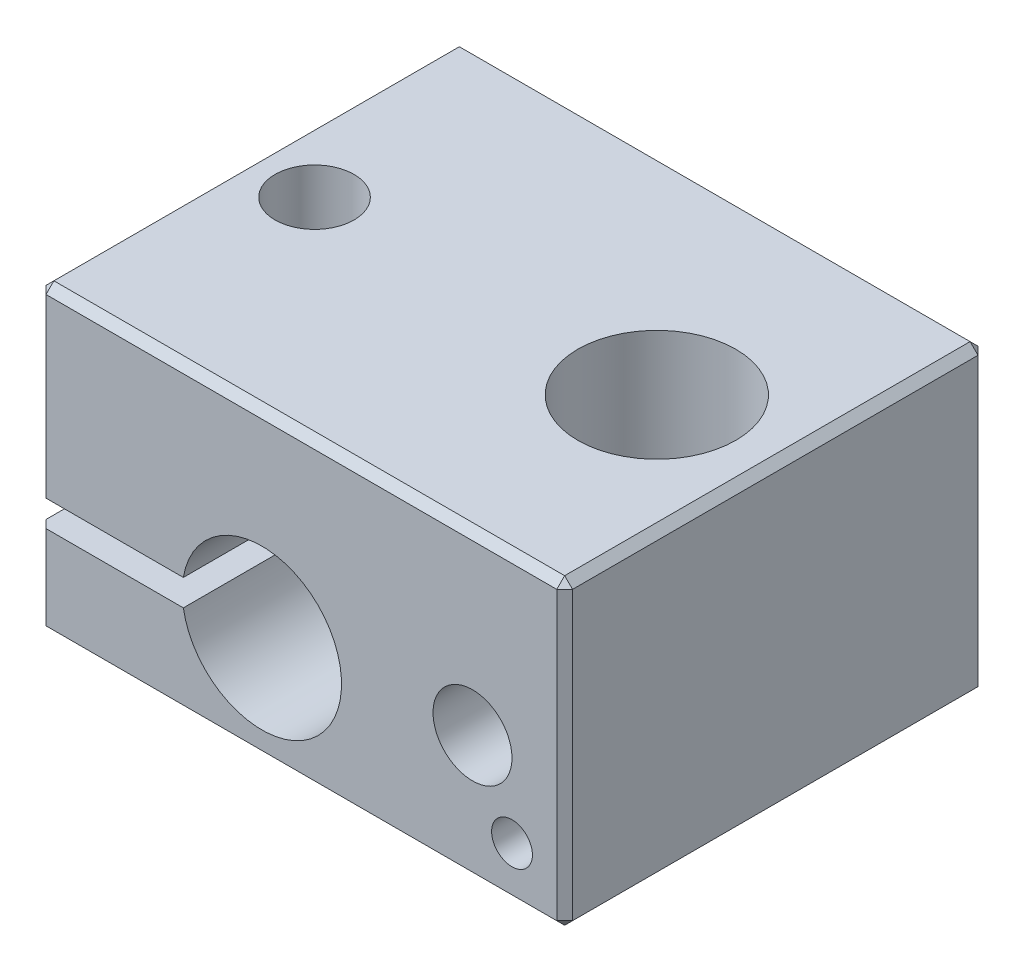
ISO-10303-21;
HEADER;
FILE_DESCRIPTION(('STEP AP214'),'2;1');
FILE_NAME('part.step','',(''),(''),'','','');
FILE_SCHEMA(('AUTOMOTIVE_DESIGN { 1 0 10303 214 1 1 1 1 }'));
ENDSEC;
DATA;
#1=APPLICATION_CONTEXT('core data for automotive mechanical design processes');
#2=APPLICATION_PROTOCOL_DEFINITION('international standard','automotive_design',2000,#1);
#3=PRODUCT_CONTEXT('',#1,'mechanical');
#4=PRODUCT('Part','Part','',(#3));
#5=PRODUCT_RELATED_PRODUCT_CATEGORY('part','',(#4));
#6=PRODUCT_DEFINITION_FORMATION('','',#4);
#7=PRODUCT_DEFINITION_CONTEXT('part definition',#1,'design');
#8=PRODUCT_DEFINITION('design','',#6,#7);
#9=PRODUCT_DEFINITION_SHAPE('','',#8);
#10=(LENGTH_UNIT() NAMED_UNIT(*) SI_UNIT(.MILLI.,.METRE.));
#11=(NAMED_UNIT(*) PLANE_ANGLE_UNIT() SI_UNIT($,.RADIAN.));
#12=(NAMED_UNIT(*) SI_UNIT($,.STERADIAN.) SOLID_ANGLE_UNIT());
#13=UNCERTAINTY_MEASURE_WITH_UNIT(LENGTH_MEASURE(1.E-05),#10,'distance_accuracy_value','');
#14=(GEOMETRIC_REPRESENTATION_CONTEXT(3) GLOBAL_UNCERTAINTY_ASSIGNED_CONTEXT((#13)) GLOBAL_UNIT_ASSIGNED_CONTEXT((#10,
#11,#12)) REPRESENTATION_CONTEXT('',''));
#15=CARTESIAN_POINT('',(0.,0.,0.));
#16=DIRECTION('',(0.,0.,1.));
#17=DIRECTION('',(1.,0.,0.));
#18=AXIS2_PLACEMENT_3D('',#15,#16,#17);
#19=CARTESIAN_POINT('',(0.,11.5,0.));
#20=DIRECTION('',(1.,0.,0.));
#21=DIRECTION('',(0.,0.,-1.));
#22=AXIS2_PLACEMENT_3D('',#19,#20,#21);
#23=PLANE('',#22);
#24=DIRECTION('',(0.,0.,1.));
#25=VECTOR('',#24,1.);
#26=CARTESIAN_POINT('',(0.,3.50000000000001,-16.));
#27=LINE('',#26,#25);
#28=CARTESIAN_POINT('',(0.,3.50000000000001,-15.7));
#29=VERTEX_POINT('',#28);
#30=CARTESIAN_POINT('',(0.,3.50000000000001,-0.300000000000001));
#31=VERTEX_POINT('',#30);
#32=EDGE_CURVE('E197',#29,#31,#27,.T.);
#33=ORIENTED_EDGE('',*,*,#32,.F.);
#34=DIRECTION('',(0.,-1.,0.));
#35=VECTOR('',#34,1.);
#36=CARTESIAN_POINT('',(0.,11.5,-15.7));
#37=LINE('',#36,#35);
#38=CARTESIAN_POINT('',(0.,0.299999999999998,-15.7));
#39=VERTEX_POINT('',#38);
#40=EDGE_CURVE('E239',#29,#39,#37,.T.);
#41=ORIENTED_EDGE('',*,*,#40,.T.);
#42=DIRECTION('',(0.,0.,1.));
#43=VECTOR('',#42,1.);
#44=CARTESIAN_POINT('',(0.,0.299999999999998,0.));
#45=LINE('',#44,#43);
#46=CARTESIAN_POINT('',(0.,0.299999999999998,-0.299999999999998));
#47=VERTEX_POINT('',#46);
#48=EDGE_CURVE('E237',#39,#47,#45,.T.);
#49=ORIENTED_EDGE('',*,*,#48,.T.);
#50=DIRECTION('',(0.,1.,0.));
#51=VECTOR('',#50,1.);
#52=CARTESIAN_POINT('',(0.,11.5,-0.299999999999998));
#53=LINE('',#52,#51);
#54=EDGE_CURVE('E235',#47,#31,#53,.T.);
#55=ORIENTED_EDGE('',*,*,#54,.T.);
#56=EDGE_LOOP('',(#33,#41,#49,#55));
#57=FACE_BOUND('',#56,.T.);
#58=ADVANCED_FACE('F33',(#57),#23,.F.);
#59=CARTESIAN_POINT('',(0.,11.5,0.));
#60=DIRECTION('',(0.,0.,-1.));
#61=DIRECTION('',(-1.,0.,0.));
#62=AXIS2_PLACEMENT_3D('',#59,#60,#61);
#63=PLANE('',#62);
#64=DIRECTION('',(-1.,0.,0.));
#65=VECTOR('',#64,1.);
#66=CARTESIAN_POINT('',(0.,3.50000000000001,0.));
#67=LINE('',#66,#65);
#68=CARTESIAN_POINT('',(5.5166084735657,3.50000000000001,0.));
#69=VERTEX_POINT('',#68);
#70=CARTESIAN_POINT('',(0.300000000000002,3.50000000000001,0.));
#71=VERTEX_POINT('',#70);
#72=EDGE_CURVE('E182',#69,#71,#67,.T.);
#73=ORIENTED_EDGE('',*,*,#72,.T.);
#74=DIRECTION('',(0.,-1.,0.));
#75=VECTOR('',#74,1.);
#76=CARTESIAN_POINT('',(0.299999999999998,11.5,0.));
#77=LINE('',#76,#75);
#78=CARTESIAN_POINT('',(0.299999999999998,0.299999999999998,0.));
#79=VERTEX_POINT('',#78);
#80=EDGE_CURVE('E11',#71,#79,#77,.T.);
#81=ORIENTED_EDGE('',*,*,#80,.T.);
#82=DIRECTION('',(1.,0.,0.));
#83=VECTOR('',#82,1.);
#84=CARTESIAN_POINT('',(20.,0.299999999999998,0.));
#85=LINE('',#84,#83);
#86=CARTESIAN_POINT('',(19.7,0.299999999999998,0.));
#87=VERTEX_POINT('',#86);
#88=EDGE_CURVE('E42',#79,#87,#85,.T.);
#89=ORIENTED_EDGE('',*,*,#88,.T.);
#90=DIRECTION('',(0.,1.,0.));
#91=VECTOR('',#90,1.);
#92=CARTESIAN_POINT('',(19.7,11.5,0.));
#93=LINE('',#92,#91);
#94=CARTESIAN_POINT('',(19.7,11.2,0.));
#95=VERTEX_POINT('',#94);
#96=EDGE_CURVE('E280',#87,#95,#93,.T.);
#97=ORIENTED_EDGE('',*,*,#96,.T.);
#98=DIRECTION('',(-1.,0.,0.));
#99=VECTOR('',#98,1.);
#100=CARTESIAN_POINT('',(0.,11.2,0.));
#101=LINE('',#100,#99);
#102=CARTESIAN_POINT('',(0.299999999999998,11.2,0.));
#103=VERTEX_POINT('',#102);
#104=EDGE_CURVE('E276',#95,#103,#101,.T.);
#105=ORIENTED_EDGE('',*,*,#104,.T.);
#106=DIRECTION('',(0.,-1.,0.));
#107=VECTOR('',#106,1.);
#108=CARTESIAN_POINT('',(0.299999999999998,11.5,0.));
#109=LINE('',#108,#107);
#110=CARTESIAN_POINT('',(0.299999999999998,4.50000000000001,0.));
#111=VERTEX_POINT('',#110);
#112=EDGE_CURVE('E278',#103,#111,#109,.T.);
#113=ORIENTED_EDGE('',*,*,#112,.T.);
#114=DIRECTION('',(-1.,0.,0.));
#115=VECTOR('',#114,1.);
#116=CARTESIAN_POINT('',(0.,4.50000000000001,0.));
#117=LINE('',#116,#115);
#118=CARTESIAN_POINT('',(5.5166084735657,4.50000000000001,0.));
#119=VERTEX_POINT('',#118);
#120=EDGE_CURVE('E184',#119,#111,#117,.T.);
#121=ORIENTED_EDGE('',*,*,#120,.F.);
#122=CARTESIAN_POINT('',(8.5,4.,0.));
#123=DIRECTION('',(0.,0.,1.));
#124=DIRECTION('',(1.,0.,0.));
#125=AXIS2_PLACEMENT_3D('',#122,#123,#124);
#126=CIRCLE('',#125,3.025);
#127=EDGE_CURVE('E164',#69,#119,#126,.T.);
#128=ORIENTED_EDGE('',*,*,#127,.F.);
#129=EDGE_LOOP('',(#73,#81,#89,#97,#105,#113,#121,#128));
#130=FACE_BOUND('',#129,.T.);
#131=CARTESIAN_POINT('',(18.,2.,0.));
#132=DIRECTION('',(0.,0.,1.));
#133=DIRECTION('',(1.,0.,0.));
#134=AXIS2_PLACEMENT_3D('',#131,#132,#133);
#135=CIRCLE('',#134,0.775000000000001);
#136=CARTESIAN_POINT('',(18.775,2.,0.));
#137=VERTEX_POINT('',#136);
#138=EDGE_CURVE('E352',#137,#137,#135,.T.);
#139=ORIENTED_EDGE('',*,*,#138,.F.);
#140=EDGE_LOOP('',(#139));
#141=FACE_BOUND('',#140,.T.);
#142=CARTESIAN_POINT('',(16.5,4.8,0.));
#143=DIRECTION('',(0.,0.,1.));
#144=DIRECTION('',(1.,0.,0.));
#145=AXIS2_PLACEMENT_3D('',#142,#143,#144);
#146=CIRCLE('',#145,1.5);
#147=CARTESIAN_POINT('',(18.,4.8,0.));
#148=VERTEX_POINT('',#147);
#149=EDGE_CURVE('E187',#148,#148,#146,.T.);
#150=ORIENTED_EDGE('',*,*,#149,.F.);
#151=EDGE_LOOP('',(#150));
#152=FACE_BOUND('',#151,.T.);
#153=ADVANCED_FACE('F369',(#130,#141,#152),#63,.F.);
#154=CARTESIAN_POINT('',(0.,11.5,-16.));
#155=DIRECTION('',(0.,0.,1.));
#156=DIRECTION('',(1.,0.,0.));
#157=AXIS2_PLACEMENT_3D('',#154,#155,#156);
#158=PLANE('',#157);
#159=DIRECTION('',(-1.,0.,0.));
#160=VECTOR('',#159,1.);
#161=CARTESIAN_POINT('',(0.,0.299999999999998,-16.));
#162=LINE('',#161,#160);
#163=CARTESIAN_POINT('',(19.7,0.299999999999998,-16.));
#164=VERTEX_POINT('',#163);
#165=CARTESIAN_POINT('',(0.299999999999998,0.299999999999998,-16.));
#166=VERTEX_POINT('',#165);
#167=EDGE_CURVE('E265',#164,#166,#162,.T.);
#168=ORIENTED_EDGE('',*,*,#167,.T.);
#169=DIRECTION('',(0.,1.,0.));
#170=VECTOR('',#169,1.);
#171=CARTESIAN_POINT('',(0.299999999999998,11.5,-16.));
#172=LINE('',#171,#170);
#173=CARTESIAN_POINT('',(0.299999999999996,3.50000000000001,-16.));
#174=VERTEX_POINT('',#173);
#175=EDGE_CURVE('E267',#166,#174,#172,.T.);
#176=ORIENTED_EDGE('',*,*,#175,.T.);
#177=DIRECTION('',(-1.,0.,0.));
#178=VECTOR('',#177,1.);
#179=CARTESIAN_POINT('',(0.,3.50000000000001,-16.));
#180=LINE('',#179,#178);
#181=CARTESIAN_POINT('',(5.5166084735657,3.50000000000001,-16.));
#182=VERTEX_POINT('',#181);
#183=EDGE_CURVE('E169',#182,#174,#180,.T.);
#184=ORIENTED_EDGE('',*,*,#183,.F.);
#185=CARTESIAN_POINT('',(8.5,4.,-16.));
#186=DIRECTION('',(0.,0.,1.));
#187=DIRECTION('',(1.,0.,0.));
#188=AXIS2_PLACEMENT_3D('',#185,#186,#187);
#189=CIRCLE('',#188,3.025);
#190=CARTESIAN_POINT('',(5.5166084735657,4.50000000000001,-16.));
#191=VERTEX_POINT('',#190);
#192=EDGE_CURVE('E161',#182,#191,#189,.T.);
#193=ORIENTED_EDGE('',*,*,#192,.T.);
#194=DIRECTION('',(-1.,0.,0.));
#195=VECTOR('',#194,1.);
#196=CARTESIAN_POINT('',(0.,4.50000000000001,-16.));
#197=LINE('',#196,#195);
#198=CARTESIAN_POINT('',(0.299999999999998,4.50000000000001,-16.));
#199=VERTEX_POINT('',#198);
#200=EDGE_CURVE('E172',#191,#199,#197,.T.);
#201=ORIENTED_EDGE('',*,*,#200,.T.);
#202=DIRECTION('',(0.,1.,0.));
#203=VECTOR('',#202,1.);
#204=CARTESIAN_POINT('',(0.299999999999998,11.5,-16.));
#205=LINE('',#204,#203);
#206=CARTESIAN_POINT('',(0.299999999999998,11.2,-16.));
#207=VERTEX_POINT('',#206);
#208=EDGE_CURVE('E261',#199,#207,#205,.T.);
#209=ORIENTED_EDGE('',*,*,#208,.T.);
#210=DIRECTION('',(1.,0.,0.));
#211=VECTOR('',#210,1.);
#212=CARTESIAN_POINT('',(0.,11.2,-16.));
#213=LINE('',#212,#211);
#214=CARTESIAN_POINT('',(19.7,11.2,-16.));
#215=VERTEX_POINT('',#214);
#216=EDGE_CURVE('E259',#207,#215,#213,.T.);
#217=ORIENTED_EDGE('',*,*,#216,.T.);
#218=DIRECTION('',(0.,-1.,0.));
#219=VECTOR('',#218,1.);
#220=CARTESIAN_POINT('',(19.7,11.5,-16.));
#221=LINE('',#220,#219);
#222=EDGE_CURVE('E263',#215,#164,#221,.T.);
#223=ORIENTED_EDGE('',*,*,#222,.T.);
#224=EDGE_LOOP('',(#168,#176,#184,#193,#201,#209,#217,#223));
#225=FACE_BOUND('',#224,.T.);
#226=ADVANCED_FACE('F180',(#225),#158,.F.);
#227=CARTESIAN_POINT('',(2.5,11.5,-8.));
#228=DIRECTION('',(0.,-1.,0.));
#229=DIRECTION('',(0.,0.,-1.));
#230=AXIS2_PLACEMENT_3D('',#227,#228,#229);
#231=CYLINDRICAL_SURFACE('',#230,1.5);
#232=CARTESIAN_POINT('',(2.5,0.,-8.));
#233=DIRECTION('',(0.,1.,0.));
#234=DIRECTION('',(0.,0.,1.));
#235=AXIS2_PLACEMENT_3D('',#232,#233,#234);
#236=CIRCLE('',#235,1.5);
#237=CARTESIAN_POINT('',(2.5,0.,-6.5));
#238=VERTEX_POINT('',#237);
#239=EDGE_CURVE('E206',#238,#238,#236,.T.);
#240=ORIENTED_EDGE('',*,*,#239,.F.);
#241=EDGE_LOOP('',(#240));
#242=FACE_BOUND('',#241,.T.);
#243=CARTESIAN_POINT('',(2.5,3.50000000000001,-8.));
#244=DIRECTION('',(0.,1.,0.));
#245=DIRECTION('',(0.,0.,1.));
#246=AXIS2_PLACEMENT_3D('',#243,#244,#245);
#247=CIRCLE('',#246,1.5);
#248=CARTESIAN_POINT('',(2.5,3.50000000000001,-6.5));
#249=VERTEX_POINT('',#248);
#250=EDGE_CURVE('E209',#249,#249,#247,.T.);
#251=ORIENTED_EDGE('',*,*,#250,.T.);
#252=EDGE_LOOP('',(#251));
#253=FACE_BOUND('',#252,.T.);
#254=ADVANCED_FACE('F376',(#242,#253),#231,.F.);
#255=CARTESIAN_POINT('',(0.,11.5,0.));
#256=DIRECTION('',(0.,-1.,0.));
#257=DIRECTION('',(0.,0.,-1.));
#258=AXIS2_PLACEMENT_3D('',#255,#256,#257);
#259=PLANE('',#258);
#260=DIRECTION('',(-1.,0.,0.));
#261=VECTOR('',#260,1.);
#262=CARTESIAN_POINT('',(0.,11.5,-15.7));
#263=LINE('',#262,#261);
#264=CARTESIAN_POINT('',(19.7,11.5,-15.7));
#265=VERTEX_POINT('',#264);
#266=CARTESIAN_POINT('',(0.299999999999998,11.5,-15.7));
#267=VERTEX_POINT('',#266);
#268=EDGE_CURVE('E223',#265,#267,#263,.T.);
#269=ORIENTED_EDGE('',*,*,#268,.T.);
#270=DIRECTION('',(0.,0.,1.));
#271=VECTOR('',#270,1.);
#272=CARTESIAN_POINT('',(0.299999999999998,11.5,0.));
#273=LINE('',#272,#271);
#274=CARTESIAN_POINT('',(0.299999999999998,11.5,-0.299999999999998));
#275=VERTEX_POINT('',#274);
#276=EDGE_CURVE('E225',#267,#275,#273,.T.);
#277=ORIENTED_EDGE('',*,*,#276,.T.);
#278=DIRECTION('',(1.,0.,0.));
#279=VECTOR('',#278,1.);
#280=CARTESIAN_POINT('',(0.,11.5,-0.299999999999998));
#281=LINE('',#280,#279);
#282=CARTESIAN_POINT('',(19.7,11.5,-0.299999999999998));
#283=VERTEX_POINT('',#282);
#284=EDGE_CURVE('E213',#275,#283,#281,.T.);
#285=ORIENTED_EDGE('',*,*,#284,.T.);
#286=DIRECTION('',(0.,0.,-1.));
#287=VECTOR('',#286,1.);
#288=CARTESIAN_POINT('',(19.7,11.5,0.));
#289=LINE('',#288,#287);
#290=EDGE_CURVE('E221',#283,#265,#289,.T.);
#291=ORIENTED_EDGE('',*,*,#290,.T.);
#292=EDGE_LOOP('',(#269,#277,#285,#291));
#293=FACE_BOUND('',#292,.T.);
#294=CARTESIAN_POINT('',(15.5,11.5,-8.));
#295=DIRECTION('',(0.,1.,0.));
#296=DIRECTION('',(0.,0.,1.));
#297=AXIS2_PLACEMENT_3D('',#294,#295,#296);
#298=CIRCLE('',#297,3.);
#299=CARTESIAN_POINT('',(15.5,11.5,-5.));
#300=VERTEX_POINT('',#299);
#301=EDGE_CURVE('E210',#300,#300,#298,.T.);
#302=ORIENTED_EDGE('',*,*,#301,.F.);
#303=EDGE_LOOP('',(#302));
#304=FACE_BOUND('',#303,.T.);
#305=CARTESIAN_POINT('',(2.5,11.5,-8.));
#306=DIRECTION('',(0.,1.,0.));
#307=DIRECTION('',(0.,0.,1.));
#308=AXIS2_PLACEMENT_3D('',#305,#306,#307);
#309=CIRCLE('',#308,1.5);
#310=CARTESIAN_POINT('',(2.5,11.5,-6.5));
#311=VERTEX_POINT('',#310);
#312=EDGE_CURVE('E202',#311,#311,#309,.T.);
#313=ORIENTED_EDGE('',*,*,#312,.F.);
#314=EDGE_LOOP('',(#313));
#315=FACE_BOUND('',#314,.T.);
#316=ADVANCED_FACE('F512',(#293,#304,#315),#259,.F.);
#317=CARTESIAN_POINT('',(0.,0.,0.));
#318=DIRECTION('',(0.,-1.,0.));
#319=DIRECTION('',(0.,0.,-1.));
#320=AXIS2_PLACEMENT_3D('',#317,#318,#319);
#321=PLANE('',#320);
#322=DIRECTION('',(0.,0.,-1.));
#323=VECTOR('',#322,1.);
#324=CARTESIAN_POINT('',(0.299999999999998,0.,-16.));
#325=LINE('',#324,#323);
#326=CARTESIAN_POINT('',(0.299999999999998,0.,-0.299999999999998));
#327=VERTEX_POINT('',#326);
#328=CARTESIAN_POINT('',(0.299999999999998,0.,-15.7));
#329=VERTEX_POINT('',#328);
#330=EDGE_CURVE('E245',#327,#329,#325,.T.);
#331=ORIENTED_EDGE('',*,*,#330,.T.);
#332=DIRECTION('',(1.,0.,0.));
#333=VECTOR('',#332,1.);
#334=CARTESIAN_POINT('',(20.,0.,-15.7));
#335=LINE('',#334,#333);
#336=CARTESIAN_POINT('',(19.7,0.,-15.7));
#337=VERTEX_POINT('',#336);
#338=EDGE_CURVE('E248',#329,#337,#335,.T.);
#339=ORIENTED_EDGE('',*,*,#338,.T.);
#340=DIRECTION('',(0.,0.,1.));
#341=VECTOR('',#340,1.);
#342=CARTESIAN_POINT('',(19.7,0.,0.));
#343=LINE('',#342,#341);
#344=CARTESIAN_POINT('',(19.7,0.,-0.299999999999998));
#345=VERTEX_POINT('',#344);
#346=EDGE_CURVE('E243',#337,#345,#343,.T.);
#347=ORIENTED_EDGE('',*,*,#346,.T.);
#348=DIRECTION('',(-1.,0.,0.));
#349=VECTOR('',#348,1.);
#350=CARTESIAN_POINT('',(0.,0.,-0.299999999999998));
#351=LINE('',#350,#349);
#352=EDGE_CURVE('E241',#345,#327,#351,.T.);
#353=ORIENTED_EDGE('',*,*,#352,.T.);
#354=EDGE_LOOP('',(#331,#339,#347,#353));
#355=FACE_BOUND('',#354,.T.);
#356=CARTESIAN_POINT('',(15.5,0.,-8.));
#357=DIRECTION('',(0.,1.,0.));
#358=DIRECTION('',(0.,0.,1.));
#359=AXIS2_PLACEMENT_3D('',#356,#357,#358);
#360=CIRCLE('',#359,3.);
#361=CARTESIAN_POINT('',(15.5,0.,-5.));
#362=VERTEX_POINT('',#361);
#363=EDGE_CURVE('E205',#362,#362,#360,.T.);
#364=ORIENTED_EDGE('',*,*,#363,.T.);
#365=EDGE_LOOP('',(#364));
#366=FACE_BOUND('',#365,.T.);
#367=ORIENTED_EDGE('',*,*,#239,.T.);
#368=EDGE_LOOP('',(#367));
#369=FACE_BOUND('',#368,.T.);
#370=ADVANCED_FACE('F386',(#355,#366,#369),#321,.T.);
#371=DIRECTION('',(0.,0.,-1.));
#372=VECTOR('',#371,1.);
#373=CARTESIAN_POINT('',(0.,11.2,0.));
#374=LINE('',#373,#372);
#375=CARTESIAN_POINT('',(0.,11.2,-0.299999999999998));
#376=VERTEX_POINT('',#375);
#377=CARTESIAN_POINT('',(0.,11.2,-15.7));
#378=VERTEX_POINT('',#377);
#379=EDGE_CURVE('E230',#376,#378,#374,.T.);
#380=ORIENTED_EDGE('',*,*,#379,.T.);
#381=DIRECTION('',(0.,-1.,0.));
#382=VECTOR('',#381,1.);
#383=CARTESIAN_POINT('',(0.,11.5,-15.7));
#384=LINE('',#383,#382);
#385=CARTESIAN_POINT('',(0.,4.50000000000001,-15.7));
#386=VERTEX_POINT('',#385);
#387=EDGE_CURVE('E233',#378,#386,#384,.T.);
#388=ORIENTED_EDGE('',*,*,#387,.T.);
#389=DIRECTION('',(0.,0.,1.));
#390=VECTOR('',#389,1.);
#391=CARTESIAN_POINT('',(0.,4.50000000000001,-16.));
#392=LINE('',#391,#390);
#393=CARTESIAN_POINT('',(0.,4.50000000000001,-0.299999999999998));
#394=VERTEX_POINT('',#393);
#395=EDGE_CURVE('E168',#386,#394,#392,.T.);
#396=ORIENTED_EDGE('',*,*,#395,.T.);
#397=DIRECTION('',(0.,1.,0.));
#398=VECTOR('',#397,1.);
#399=CARTESIAN_POINT('',(0.,11.5,-0.299999999999998));
#400=LINE('',#399,#398);
#401=EDGE_CURVE('E228',#394,#376,#400,.T.);
#402=ORIENTED_EDGE('',*,*,#401,.T.);
#403=EDGE_LOOP('',(#380,#388,#396,#402));
#404=FACE_BOUND('',#403,.T.);
#405=ADVANCED_FACE('F380',(#404),#23,.F.);
#406=CARTESIAN_POINT('',(20.,11.5,0.));
#407=DIRECTION('',(-1.,0.,0.));
#408=DIRECTION('',(0.,0.,1.));
#409=AXIS2_PLACEMENT_3D('',#406,#407,#408);
#410=PLANE('',#409);
#411=DIRECTION('',(0.,-1.,0.));
#412=VECTOR('',#411,1.);
#413=CARTESIAN_POINT('',(20.,11.5,-0.299999999999998));
#414=LINE('',#413,#412);
#415=CARTESIAN_POINT('',(20.,11.2,-0.299999999999998));
#416=VERTEX_POINT('',#415);
#417=CARTESIAN_POINT('',(20.,0.299999999999998,-0.299999999999998));
#418=VERTEX_POINT('',#417);
#419=EDGE_CURVE('E250',#416,#418,#414,.T.);
#420=ORIENTED_EDGE('',*,*,#419,.T.);
#421=DIRECTION('',(0.,0.,-1.));
#422=VECTOR('',#421,1.);
#423=CARTESIAN_POINT('',(20.,0.299999999999998,-16.));
#424=LINE('',#423,#422);
#425=CARTESIAN_POINT('',(20.,0.299999999999998,-15.7));
#426=VERTEX_POINT('',#425);
#427=EDGE_CURVE('E256',#418,#426,#424,.T.);
#428=ORIENTED_EDGE('',*,*,#427,.T.);
#429=DIRECTION('',(0.,1.,0.));
#430=VECTOR('',#429,1.);
#431=CARTESIAN_POINT('',(20.,11.5,-15.7));
#432=LINE('',#431,#430);
#433=CARTESIAN_POINT('',(20.,11.2,-15.7));
#434=VERTEX_POINT('',#433);
#435=EDGE_CURVE('E254',#426,#434,#432,.T.);
#436=ORIENTED_EDGE('',*,*,#435,.T.);
#437=DIRECTION('',(0.,0.,1.));
#438=VECTOR('',#437,1.);
#439=CARTESIAN_POINT('',(20.,11.2,0.));
#440=LINE('',#439,#438);
#441=EDGE_CURVE('E252',#434,#416,#440,.T.);
#442=ORIENTED_EDGE('',*,*,#441,.T.);
#443=EDGE_LOOP('',(#420,#428,#436,#442));
#444=FACE_BOUND('',#443,.T.);
#445=ADVANCED_FACE('F383',(#444),#410,.F.);
#446=CARTESIAN_POINT('',(15.5,11.5,-8.));
#447=DIRECTION('',(0.,-1.,0.));
#448=DIRECTION('',(0.,0.,-1.));
#449=AXIS2_PLACEMENT_3D('',#446,#447,#448);
#450=CYLINDRICAL_SURFACE('',#449,3.);
#451=ORIENTED_EDGE('',*,*,#301,.T.);
#452=EDGE_LOOP('',(#451));
#453=FACE_BOUND('',#452,.T.);
#454=ORIENTED_EDGE('',*,*,#363,.F.);
#455=EDGE_LOOP('',(#454));
#456=FACE_BOUND('',#455,.T.);
#457=ADVANCED_FACE('F537',(#453,#456),#450,.F.);
#458=CARTESIAN_POINT('',(2.5,4.50000000000001,-8.));
#459=DIRECTION('',(0.,1.,0.));
#460=DIRECTION('',(0.,0.,1.));
#461=AXIS2_PLACEMENT_3D('',#458,#459,#460);
#462=CIRCLE('',#461,1.5);
#463=CARTESIAN_POINT('',(2.5,4.50000000000001,-6.5));
#464=VERTEX_POINT('',#463);
#465=EDGE_CURVE('E196',#464,#464,#462,.T.);
#466=ORIENTED_EDGE('',*,*,#465,.F.);
#467=EDGE_LOOP('',(#466));
#468=FACE_BOUND('',#467,.T.);
#469=ORIENTED_EDGE('',*,*,#312,.T.);
#470=EDGE_LOOP('',(#469));
#471=FACE_BOUND('',#470,.T.);
#472=ADVANCED_FACE('F521',(#468,#471),#231,.F.);
#473=CARTESIAN_POINT('',(8.5,4.,-16.));
#474=DIRECTION('',(0.,0.,1.));
#475=DIRECTION('',(1.,0.,0.));
#476=AXIS2_PLACEMENT_3D('',#473,#474,#475);
#477=CYLINDRICAL_SURFACE('',#476,3.025);
#478=ORIENTED_EDGE('',*,*,#127,.T.);
#479=DIRECTION('',(0.,0.,1.));
#480=VECTOR('',#479,1.);
#481=CARTESIAN_POINT('',(5.5166084735657,4.50000000000001,-16.));
#482=LINE('',#481,#480);
#483=EDGE_CURVE('E157',#191,#119,#482,.T.);
#484=ORIENTED_EDGE('',*,*,#483,.F.);
#485=ORIENTED_EDGE('',*,*,#192,.F.);
#486=DIRECTION('',(0.,0.,1.));
#487=VECTOR('',#486,1.);
#488=CARTESIAN_POINT('',(5.5166084735657,3.50000000000001,-16.));
#489=LINE('',#488,#487);
#490=EDGE_CURVE('E194',#182,#69,#489,.T.);
#491=ORIENTED_EDGE('',*,*,#490,.T.);
#492=EDGE_LOOP('',(#478,#484,#485,#491));
#493=FACE_BOUND('',#492,.T.);
#494=ADVANCED_FACE('F159',(#493),#477,.F.);
#495=CARTESIAN_POINT('',(0.,3.50000000000001,-16.));
#496=DIRECTION('',(0.,1.,0.));
#497=DIRECTION('',(0.,0.,1.));
#498=AXIS2_PLACEMENT_3D('',#495,#496,#497);
#499=PLANE('',#498);
#500=ORIENTED_EDGE('',*,*,#250,.F.);
#501=EDGE_LOOP('',(#500));
#502=FACE_BOUND('',#501,.T.);
#503=ORIENTED_EDGE('',*,*,#183,.T.);
#504=DIRECTION('',(0.707106781186548,0.,-0.707106781186548));
#505=VECTOR('',#504,1.);
#506=CARTESIAN_POINT('',(0.149999999999999,3.50000000000001,-15.85));
#507=LINE('',#506,#505);
#508=EDGE_CURVE('E271',#174,#29,#507,.F.);
#509=ORIENTED_EDGE('',*,*,#508,.T.);
#510=ORIENTED_EDGE('',*,*,#32,.T.);
#511=DIRECTION('',(-0.707106781186548,0.,-0.707106781186548));
#512=VECTOR('',#511,1.);
#513=CARTESIAN_POINT('',(-7.85,3.50000000000001,-8.15));
#514=LINE('',#513,#512);
#515=EDGE_CURVE('E269',#31,#71,#514,.F.);
#516=ORIENTED_EDGE('',*,*,#515,.T.);
#517=ORIENTED_EDGE('',*,*,#72,.F.);
#518=ORIENTED_EDGE('',*,*,#490,.F.);
#519=EDGE_LOOP('',(#503,#509,#510,#516,#517,#518));
#520=FACE_BOUND('',#519,.T.);
#521=ADVANCED_FACE('F483',(#502,#520),#499,.T.);
#522=CARTESIAN_POINT('',(0.,4.50000000000001,-16.));
#523=DIRECTION('',(0.,1.,0.));
#524=DIRECTION('',(0.,0.,1.));
#525=AXIS2_PLACEMENT_3D('',#522,#523,#524);
#526=PLANE('',#525);
#527=ORIENTED_EDGE('',*,*,#465,.T.);
#528=EDGE_LOOP('',(#527));
#529=FACE_BOUND('',#528,.T.);
#530=ORIENTED_EDGE('',*,*,#395,.F.);
#531=DIRECTION('',(-0.707106781186548,0.,0.707106781186548));
#532=VECTOR('',#531,1.);
#533=CARTESIAN_POINT('',(0.,4.50000000000001,-15.7));
#534=LINE('',#533,#532);
#535=EDGE_CURVE('E176',#386,#199,#534,.F.);
#536=ORIENTED_EDGE('',*,*,#535,.T.);
#537=ORIENTED_EDGE('',*,*,#200,.F.);
#538=ORIENTED_EDGE('',*,*,#483,.T.);
#539=ORIENTED_EDGE('',*,*,#120,.T.);
#540=DIRECTION('',(0.707106781186548,0.,0.707106781186548));
#541=VECTOR('',#540,1.);
#542=CARTESIAN_POINT('',(0.299999999999998,4.50000000000001,0.));
#543=LINE('',#542,#541);
#544=EDGE_CURVE('E273',#111,#394,#543,.F.);
#545=ORIENTED_EDGE('',*,*,#544,.T.);
#546=EDGE_LOOP('',(#530,#536,#537,#538,#539,#545));
#547=FACE_BOUND('',#546,.T.);
#548=ADVANCED_FACE('F174',(#529,#547),#526,.F.);
#549=CARTESIAN_POINT('',(16.5,4.8,-4.));
#550=DIRECTION('',(0.,0.,1.));
#551=DIRECTION('',(1.,0.,0.));
#552=AXIS2_PLACEMENT_3D('',#549,#550,#551);
#553=CYLINDRICAL_SURFACE('',#552,1.5);
#554=CARTESIAN_POINT('',(16.5,4.8,-4.));
#555=DIRECTION('',(0.,0.,1.));
#556=DIRECTION('',(1.,0.,0.));
#557=AXIS2_PLACEMENT_3D('',#554,#555,#556);
#558=CIRCLE('',#557,1.5);
#559=CARTESIAN_POINT('',(18.,4.8,-4.));
#560=VERTEX_POINT('',#559);
#561=EDGE_CURVE('E192',#560,#560,#558,.T.);
#562=ORIENTED_EDGE('',*,*,#561,.F.);
#563=EDGE_LOOP('',(#562));
#564=FACE_BOUND('',#563,.T.);
#565=ORIENTED_EDGE('',*,*,#149,.T.);
#566=EDGE_LOOP('',(#565));
#567=FACE_BOUND('',#566,.T.);
#568=ADVANCED_FACE('F367',(#564,#567),#553,.F.);
#569=CARTESIAN_POINT('',(16.5,4.8,-4.));
#570=DIRECTION('',(0.,0.,1.));
#571=DIRECTION('',(1.,0.,0.));
#572=AXIS2_PLACEMENT_3D('',#569,#570,#571);
#573=PLANE('',#572);
#574=ORIENTED_EDGE('',*,*,#561,.T.);
#575=EDGE_LOOP('',(#574));
#576=FACE_BOUND('',#575,.T.);
#577=ADVANCED_FACE('F606',(#576),#573,.T.);
#578=CARTESIAN_POINT('',(18.,2.,-4.));
#579=DIRECTION('',(0.,0.,1.));
#580=DIRECTION('',(1.,0.,0.));
#581=AXIS2_PLACEMENT_3D('',#578,#579,#580);
#582=CYLINDRICAL_SURFACE('',#581,0.775000000000001);
#583=CARTESIAN_POINT('',(18.,2.,-4.));
#584=DIRECTION('',(0.,0.,1.));
#585=DIRECTION('',(1.,0.,0.));
#586=AXIS2_PLACEMENT_3D('',#583,#584,#585);
#587=CIRCLE('',#586,0.775000000000001);
#588=CARTESIAN_POINT('',(18.775,2.,-4.));
#589=VERTEX_POINT('',#588);
#590=EDGE_CURVE('E355',#589,#589,#587,.T.);
#591=ORIENTED_EDGE('',*,*,#590,.F.);
#592=EDGE_LOOP('',(#591));
#593=FACE_BOUND('',#592,.T.);
#594=ORIENTED_EDGE('',*,*,#138,.T.);
#595=EDGE_LOOP('',(#594));
#596=FACE_BOUND('',#595,.T.);
#597=ADVANCED_FACE('F616',(#593,#596),#582,.F.);
#598=CARTESIAN_POINT('',(18.,2.,-4.));
#599=DIRECTION('',(0.,0.,1.));
#600=DIRECTION('',(1.,0.,0.));
#601=AXIS2_PLACEMENT_3D('',#598,#599,#600);
#602=PLANE('',#601);
#603=ORIENTED_EDGE('',*,*,#590,.T.);
#604=EDGE_LOOP('',(#603));
#605=FACE_BOUND('',#604,.T.);
#606=ADVANCED_FACE('F472',(#605),#602,.T.);
#607=CARTESIAN_POINT('',(0.,11.5,-15.7));
#608=DIRECTION('',(0.707106781186547,0.,0.707106781186547));
#609=DIRECTION('',(0.,-1.,0.));
#610=AXIS2_PLACEMENT_3D('',#607,#608,#609);
#611=PLANE('',#610);
#612=ORIENTED_EDGE('',*,*,#508,.F.);
#613=ORIENTED_EDGE('',*,*,#175,.F.);
#614=DIRECTION('',(-0.707106781186547,0.,0.707106781186547));
#615=VECTOR('',#614,1.);
#616=CARTESIAN_POINT('',(0.149999999999999,0.299999999999998,-15.85));
#617=LINE('',#616,#615);
#618=EDGE_CURVE('E37',#39,#166,#617,.F.);
#619=ORIENTED_EDGE('',*,*,#618,.F.);
#620=ORIENTED_EDGE('',*,*,#40,.F.);
#621=EDGE_LOOP('',(#612,#613,#619,#620));
#622=FACE_BOUND('',#621,.T.);
#623=ADVANCED_FACE('F35',(#622),#611,.F.);
#624=CARTESIAN_POINT('',(0.,0.299999999999998,0.));
#625=DIRECTION('',(-0.707106781186547,-0.707106781186547,0.));
#626=DIRECTION('',(0.,0.,-1.));
#627=AXIS2_PLACEMENT_3D('',#624,#625,#626);
#628=PLANE('',#627);
#629=DIRECTION('',(0.707106781186547,-0.707106781186547,0.));
#630=VECTOR('',#629,1.);
#631=CARTESIAN_POINT('',(0.,0.299999999999998,-0.299999999999998));
#632=LINE('',#631,#630);
#633=EDGE_CURVE('E344',#47,#327,#632,.T.);
#634=ORIENTED_EDGE('',*,*,#633,.F.);
#635=ORIENTED_EDGE('',*,*,#48,.F.);
#636=DIRECTION('',(-0.707106781186547,0.707106781186547,0.));
#637=VECTOR('',#636,1.);
#638=CARTESIAN_POINT('',(0.299999999999998,0.,-15.7));
#639=LINE('',#638,#637);
#640=EDGE_CURVE('E346',#329,#39,#639,.T.);
#641=ORIENTED_EDGE('',*,*,#640,.F.);
#642=ORIENTED_EDGE('',*,*,#330,.F.);
#643=EDGE_LOOP('',(#634,#635,#641,#642));
#644=FACE_BOUND('',#643,.T.);
#645=ADVANCED_FACE('F465',(#644),#628,.T.);
#646=CARTESIAN_POINT('',(0.299999999999998,11.5,0.));
#647=DIRECTION('',(0.707106781186547,0.,-0.707106781186547));
#648=DIRECTION('',(0.,-1.,0.));
#649=AXIS2_PLACEMENT_3D('',#646,#647,#648);
#650=PLANE('',#649);
#651=ORIENTED_EDGE('',*,*,#515,.F.);
#652=ORIENTED_EDGE('',*,*,#54,.F.);
#653=DIRECTION('',(0.707106781186547,0.,0.707106781186547));
#654=VECTOR('',#653,1.);
#655=CARTESIAN_POINT('',(0.,0.299999999999998,-0.299999999999998));
#656=LINE('',#655,#654);
#657=EDGE_CURVE('E341',#79,#47,#656,.F.);
#658=ORIENTED_EDGE('',*,*,#657,.F.);
#659=ORIENTED_EDGE('',*,*,#80,.F.);
#660=EDGE_LOOP('',(#651,#652,#658,#659));
#661=FACE_BOUND('',#660,.T.);
#662=ADVANCED_FACE('F463',(#661),#650,.F.);
#663=CARTESIAN_POINT('',(0.299999999999998,0.,-15.7));
#664=DIRECTION('',(-0.577350269189626,-0.577350269189626,-0.577350269189626));
#665=DIRECTION('',(-0.707106781186547,0.,0.707106781186547));
#666=AXIS2_PLACEMENT_3D('',#663,#664,#665);
#667=PLANE('',#666);
#668=ORIENTED_EDGE('',*,*,#640,.T.);
#669=ORIENTED_EDGE('',*,*,#618,.T.);
#670=DIRECTION('',(0.,-0.707106781186547,0.707106781186547));
#671=VECTOR('',#670,1.);
#672=CARTESIAN_POINT('',(0.299999999999998,0.,-15.7));
#673=LINE('',#672,#671);
#674=EDGE_CURVE('E338',#329,#166,#673,.F.);
#675=ORIENTED_EDGE('',*,*,#674,.F.);
#676=EDGE_LOOP('',(#668,#669,#675));
#677=FACE_BOUND('',#676,.T.);
#678=ADVANCED_FACE('F459',(#677),#667,.T.);
#679=CARTESIAN_POINT('',(0.,0.299999999999998,-0.299999999999998));
#680=DIRECTION('',(-0.577350269189626,-0.577350269189626,0.577350269189626));
#681=DIRECTION('',(0.707106781186547,0.,0.707106781186547));
#682=AXIS2_PLACEMENT_3D('',#679,#680,#681);
#683=PLANE('',#682);
#684=ORIENTED_EDGE('',*,*,#657,.T.);
#685=ORIENTED_EDGE('',*,*,#633,.T.);
#686=DIRECTION('',(0.,0.707106781186547,0.707106781186547));
#687=VECTOR('',#686,1.);
#688=CARTESIAN_POINT('',(0.299999999999998,0.149999999999999,-0.149999999999999));
#689=LINE('',#688,#687);
#690=EDGE_CURVE('E335',#79,#327,#689,.F.);
#691=ORIENTED_EDGE('',*,*,#690,.F.);
#692=EDGE_LOOP('',(#684,#685,#691));
#693=FACE_BOUND('',#692,.T.);
#694=ADVANCED_FACE('F455',(#693),#683,.T.);
#695=CARTESIAN_POINT('',(0.,0.299999999999998,-16.));
#696=DIRECTION('',(0.,-0.707106781186547,-0.707106781186547));
#697=DIRECTION('',(1.,0.,0.));
#698=AXIS2_PLACEMENT_3D('',#695,#696,#697);
#699=PLANE('',#698);
#700=ORIENTED_EDGE('',*,*,#674,.T.);
#701=ORIENTED_EDGE('',*,*,#167,.F.);
#702=DIRECTION('',(0.,0.707106781186547,-0.707106781186547));
#703=VECTOR('',#702,1.);
#704=CARTESIAN_POINT('',(19.7,0.149999999999999,-15.85));
#705=LINE('',#704,#703);
#706=EDGE_CURVE('E332',#337,#164,#705,.T.);
#707=ORIENTED_EDGE('',*,*,#706,.F.);
#708=ORIENTED_EDGE('',*,*,#338,.F.);
#709=EDGE_LOOP('',(#700,#701,#707,#708));
#710=FACE_BOUND('',#709,.T.);
#711=ADVANCED_FACE('F451',(#710),#699,.T.);
#712=CARTESIAN_POINT('',(20.,0.299999999999998,0.));
#713=DIRECTION('',(0.707106781186547,-0.707106781186547,0.));
#714=DIRECTION('',(0.,0.,1.));
#715=AXIS2_PLACEMENT_3D('',#712,#713,#714);
#716=PLANE('',#715);
#717=DIRECTION('',(0.707106781186547,0.707106781186547,0.));
#718=VECTOR('',#717,1.);
#719=CARTESIAN_POINT('',(19.7,0.,-0.299999999999998));
#720=LINE('',#719,#718);
#721=EDGE_CURVE('E326',#345,#418,#720,.T.);
#722=ORIENTED_EDGE('',*,*,#721,.F.);
#723=ORIENTED_EDGE('',*,*,#346,.F.);
#724=DIRECTION('',(-0.707106781186547,-0.707106781186547,0.));
#725=VECTOR('',#724,1.);
#726=CARTESIAN_POINT('',(20.,0.299999999999998,-15.7));
#727=LINE('',#726,#725);
#728=EDGE_CURVE('E329',#426,#337,#727,.T.);
#729=ORIENTED_EDGE('',*,*,#728,.F.);
#730=ORIENTED_EDGE('',*,*,#427,.F.);
#731=EDGE_LOOP('',(#722,#723,#729,#730));
#732=FACE_BOUND('',#731,.T.);
#733=ADVANCED_FACE('F447',(#732),#716,.T.);
#734=CARTESIAN_POINT('',(0.,0.299999999999998,0.));
#735=DIRECTION('',(0.,-0.707106781186547,0.707106781186547));
#736=DIRECTION('',(-1.,0.,0.));
#737=AXIS2_PLACEMENT_3D('',#734,#735,#736);
#738=PLANE('',#737);
#739=ORIENTED_EDGE('',*,*,#690,.T.);
#740=ORIENTED_EDGE('',*,*,#352,.F.);
#741=DIRECTION('',(0.,-0.707106781186547,-0.707106781186547));
#742=VECTOR('',#741,1.);
#743=CARTESIAN_POINT('',(19.7,0.,-0.299999999999998));
#744=LINE('',#743,#742);
#745=EDGE_CURVE('E323',#87,#345,#744,.T.);
#746=ORIENTED_EDGE('',*,*,#745,.F.);
#747=ORIENTED_EDGE('',*,*,#88,.F.);
#748=EDGE_LOOP('',(#739,#740,#746,#747));
#749=FACE_BOUND('',#748,.T.);
#750=ADVANCED_FACE('F443',(#749),#738,.T.);
#751=CARTESIAN_POINT('',(20.,0.299999999999998,-15.7));
#752=DIRECTION('',(0.577350269189626,-0.577350269189626,-0.577350269189626));
#753=DIRECTION('',(-0.707106781186547,0.,-0.707106781186547));
#754=AXIS2_PLACEMENT_3D('',#751,#752,#753);
#755=PLANE('',#754);
#756=ORIENTED_EDGE('',*,*,#728,.T.);
#757=ORIENTED_EDGE('',*,*,#706,.T.);
#758=DIRECTION('',(-0.707106781186547,0.,-0.707106781186547));
#759=VECTOR('',#758,1.);
#760=CARTESIAN_POINT('',(20.,0.299999999999998,-15.7));
#761=LINE('',#760,#759);
#762=EDGE_CURVE('E320',#426,#164,#761,.T.);
#763=ORIENTED_EDGE('',*,*,#762,.F.);
#764=EDGE_LOOP('',(#756,#757,#763));
#765=FACE_BOUND('',#764,.T.);
#766=ADVANCED_FACE('F439',(#765),#755,.T.);
#767=CARTESIAN_POINT('',(19.7,0.,-0.299999999999998));
#768=DIRECTION('',(0.577350269189626,-0.577350269189626,0.577350269189626));
#769=DIRECTION('',(0.707106781186547,0.,-0.707106781186547));
#770=AXIS2_PLACEMENT_3D('',#767,#768,#769);
#771=PLANE('',#770);
#772=ORIENTED_EDGE('',*,*,#745,.T.);
#773=ORIENTED_EDGE('',*,*,#721,.T.);
#774=DIRECTION('',(0.707106781186547,0.,-0.707106781186547));
#775=VECTOR('',#774,1.);
#776=CARTESIAN_POINT('',(19.85,0.299999999999998,-0.149999999999999));
#777=LINE('',#776,#775);
#778=EDGE_CURVE('E317',#87,#418,#777,.T.);
#779=ORIENTED_EDGE('',*,*,#778,.F.);
#780=EDGE_LOOP('',(#772,#773,#779));
#781=FACE_BOUND('',#780,.T.);
#782=ADVANCED_FACE('F435',(#781),#771,.T.);
#783=CARTESIAN_POINT('',(19.7,11.5,-16.));
#784=DIRECTION('',(-0.707106781186547,0.,0.707106781186547));
#785=DIRECTION('',(0.,-1.,0.));
#786=AXIS2_PLACEMENT_3D('',#783,#784,#785);
#787=PLANE('',#786);
#788=ORIENTED_EDGE('',*,*,#762,.T.);
#789=ORIENTED_EDGE('',*,*,#222,.F.);
#790=DIRECTION('',(0.707106781186547,0.,0.707106781186547));
#791=VECTOR('',#790,1.);
#792=CARTESIAN_POINT('',(20.,11.2,-15.7));
#793=LINE('',#792,#791);
#794=EDGE_CURVE('E314',#434,#215,#793,.F.);
#795=ORIENTED_EDGE('',*,*,#794,.F.);
#796=ORIENTED_EDGE('',*,*,#435,.F.);
#797=EDGE_LOOP('',(#788,#789,#795,#796));
#798=FACE_BOUND('',#797,.T.);
#799=ADVANCED_FACE('F431',(#798),#787,.F.);
#800=CARTESIAN_POINT('',(19.7,11.5,0.));
#801=DIRECTION('',(-0.707106781186547,-0.707106781186547,0.));
#802=DIRECTION('',(0.,0.,-1.));
#803=AXIS2_PLACEMENT_3D('',#800,#801,#802);
#804=PLANE('',#803);
#805=DIRECTION('',(0.707106781186547,-0.707106781186547,0.));
#806=VECTOR('',#805,1.);
#807=CARTESIAN_POINT('',(20.,11.2,-0.299999999999998));
#808=LINE('',#807,#806);
#809=EDGE_CURVE('E308',#416,#283,#808,.F.);
#810=ORIENTED_EDGE('',*,*,#809,.F.);
#811=ORIENTED_EDGE('',*,*,#441,.F.);
#812=DIRECTION('',(-0.707106781186547,0.707106781186547,0.));
#813=VECTOR('',#812,1.);
#814=CARTESIAN_POINT('',(20.,11.2,-15.7));
#815=LINE('',#814,#813);
#816=EDGE_CURVE('E311',#265,#434,#815,.F.);
#817=ORIENTED_EDGE('',*,*,#816,.F.);
#818=ORIENTED_EDGE('',*,*,#290,.F.);
#819=EDGE_LOOP('',(#810,#811,#817,#818));
#820=FACE_BOUND('',#819,.T.);
#821=ADVANCED_FACE('F427',(#820),#804,.F.);
#822=CARTESIAN_POINT('',(20.,11.5,-0.299999999999998));
#823=DIRECTION('',(-0.707106781186547,0.,-0.707106781186547));
#824=DIRECTION('',(0.,-1.,0.));
#825=AXIS2_PLACEMENT_3D('',#822,#823,#824);
#826=PLANE('',#825);
#827=ORIENTED_EDGE('',*,*,#778,.T.);
#828=ORIENTED_EDGE('',*,*,#419,.F.);
#829=DIRECTION('',(-0.707106781186547,0.,0.707106781186547));
#830=VECTOR('',#829,1.);
#831=CARTESIAN_POINT('',(20.,11.2,-0.299999999999998));
#832=LINE('',#831,#830);
#833=EDGE_CURVE('E305',#95,#416,#832,.F.);
#834=ORIENTED_EDGE('',*,*,#833,.F.);
#835=ORIENTED_EDGE('',*,*,#96,.F.);
#836=EDGE_LOOP('',(#827,#828,#834,#835));
#837=FACE_BOUND('',#836,.T.);
#838=ADVANCED_FACE('F423',(#837),#826,.F.);
#839=CARTESIAN_POINT('',(20.,11.2,-15.7));
#840=DIRECTION('',(0.577350269189626,0.577350269189626,-0.577350269189626));
#841=DIRECTION('',(-0.707106781186547,0.,-0.707106781186547));
#842=AXIS2_PLACEMENT_3D('',#839,#840,#841);
#843=PLANE('',#842);
#844=ORIENTED_EDGE('',*,*,#816,.T.);
#845=ORIENTED_EDGE('',*,*,#794,.T.);
#846=DIRECTION('',(0.,-0.707106781186547,-0.707106781186547));
#847=VECTOR('',#846,1.);
#848=CARTESIAN_POINT('',(19.7,11.35,-15.85));
#849=LINE('',#848,#847);
#850=EDGE_CURVE('E302',#265,#215,#849,.T.);
#851=ORIENTED_EDGE('',*,*,#850,.F.);
#852=EDGE_LOOP('',(#844,#845,#851));
#853=FACE_BOUND('',#852,.T.);
#854=ADVANCED_FACE('F419',(#853),#843,.T.);
#855=CARTESIAN_POINT('',(20.,11.2,-0.299999999999998));
#856=DIRECTION('',(0.577350269189626,0.577350269189626,0.577350269189626));
#857=DIRECTION('',(0.707106781186547,0.,-0.707106781186547));
#858=AXIS2_PLACEMENT_3D('',#855,#856,#857);
#859=PLANE('',#858);
#860=ORIENTED_EDGE('',*,*,#833,.T.);
#861=ORIENTED_EDGE('',*,*,#809,.T.);
#862=DIRECTION('',(0.,0.707106781186547,-0.707106781186547));
#863=VECTOR('',#862,1.);
#864=CARTESIAN_POINT('',(19.7,11.35,-0.149999999999999));
#865=LINE('',#864,#863);
#866=EDGE_CURVE('E299',#95,#283,#865,.T.);
#867=ORIENTED_EDGE('',*,*,#866,.F.);
#868=EDGE_LOOP('',(#860,#861,#867));
#869=FACE_BOUND('',#868,.T.);
#870=ADVANCED_FACE('F415',(#869),#859,.T.);
#871=CARTESIAN_POINT('',(0.,11.5,-15.7));
#872=DIRECTION('',(0.707106781186547,0.,0.707106781186547));
#873=DIRECTION('',(0.,-1.,0.));
#874=AXIS2_PLACEMENT_3D('',#871,#872,#873);
#875=PLANE('',#874);
#876=ORIENTED_EDGE('',*,*,#535,.F.);
#877=ORIENTED_EDGE('',*,*,#387,.F.);
#878=DIRECTION('',(0.707106781186547,0.,-0.707106781186547));
#879=VECTOR('',#878,1.);
#880=CARTESIAN_POINT('',(0.,11.2,-15.7));
#881=LINE('',#880,#879);
#882=EDGE_CURVE('E296',#207,#378,#881,.F.);
#883=ORIENTED_EDGE('',*,*,#882,.F.);
#884=ORIENTED_EDGE('',*,*,#208,.F.);
#885=EDGE_LOOP('',(#876,#877,#883,#884));
#886=FACE_BOUND('',#885,.T.);
#887=ADVANCED_FACE('F411',(#886),#875,.F.);
#888=CARTESIAN_POINT('',(0.,11.5,-15.7));
#889=DIRECTION('',(0.,-0.707106781186547,0.707106781186547));
#890=DIRECTION('',(-1.,0.,0.));
#891=AXIS2_PLACEMENT_3D('',#888,#889,#890);
#892=PLANE('',#891);
#893=ORIENTED_EDGE('',*,*,#850,.T.);
#894=ORIENTED_EDGE('',*,*,#216,.F.);
#895=DIRECTION('',(0.,0.707106781186547,0.707106781186547));
#896=VECTOR('',#895,1.);
#897=CARTESIAN_POINT('',(0.299999999999998,11.35,-15.85));
#898=LINE('',#897,#896);
#899=EDGE_CURVE('E293',#267,#207,#898,.F.);
#900=ORIENTED_EDGE('',*,*,#899,.F.);
#901=ORIENTED_EDGE('',*,*,#268,.F.);
#902=EDGE_LOOP('',(#893,#894,#900,#901));
#903=FACE_BOUND('',#902,.T.);
#904=ADVANCED_FACE('F407',(#903),#892,.F.);
#905=CARTESIAN_POINT('',(0.,11.5,-0.299999999999998));
#906=DIRECTION('',(0.,-0.707106781186547,-0.707106781186547));
#907=DIRECTION('',(1.,0.,0.));
#908=AXIS2_PLACEMENT_3D('',#905,#906,#907);
#909=PLANE('',#908);
#910=ORIENTED_EDGE('',*,*,#866,.T.);
#911=ORIENTED_EDGE('',*,*,#284,.F.);
#912=DIRECTION('',(0.,-0.707106781186547,0.707106781186547));
#913=VECTOR('',#912,1.);
#914=CARTESIAN_POINT('',(0.299999999999998,11.5,-0.299999999999998));
#915=LINE('',#914,#913);
#916=EDGE_CURVE('E290',#103,#275,#915,.F.);
#917=ORIENTED_EDGE('',*,*,#916,.F.);
#918=ORIENTED_EDGE('',*,*,#104,.F.);
#919=EDGE_LOOP('',(#910,#911,#917,#918));
#920=FACE_BOUND('',#919,.T.);
#921=ADVANCED_FACE('F403',(#920),#909,.F.);
#922=CARTESIAN_POINT('',(0.299999999999998,11.5,0.));
#923=DIRECTION('',(0.707106781186547,0.,-0.707106781186547));
#924=DIRECTION('',(0.,-1.,0.));
#925=AXIS2_PLACEMENT_3D('',#922,#923,#924);
#926=PLANE('',#925);
#927=ORIENTED_EDGE('',*,*,#544,.F.);
#928=ORIENTED_EDGE('',*,*,#112,.F.);
#929=DIRECTION('',(-0.707106781186547,0.,-0.707106781186547));
#930=VECTOR('',#929,1.);
#931=CARTESIAN_POINT('',(0.149999999999999,11.2,-0.149999999999999));
#932=LINE('',#931,#930);
#933=EDGE_CURVE('E287',#376,#103,#932,.F.);
#934=ORIENTED_EDGE('',*,*,#933,.F.);
#935=ORIENTED_EDGE('',*,*,#401,.F.);
#936=EDGE_LOOP('',(#927,#928,#934,#935));
#937=FACE_BOUND('',#936,.T.);
#938=ADVANCED_FACE('F399',(#937),#926,.F.);
#939=CARTESIAN_POINT('',(0.,11.2,-15.7));
#940=DIRECTION('',(-0.577350269189626,0.577350269189626,-0.577350269189626));
#941=DIRECTION('',(-0.707106781186547,0.,0.707106781186547));
#942=AXIS2_PLACEMENT_3D('',#939,#940,#941);
#943=PLANE('',#942);
#944=ORIENTED_EDGE('',*,*,#899,.T.);
#945=ORIENTED_EDGE('',*,*,#882,.T.);
#946=DIRECTION('',(-0.707106781186547,-0.707106781186547,0.));
#947=VECTOR('',#946,1.);
#948=CARTESIAN_POINT('',(0.,11.2,-15.7));
#949=LINE('',#948,#947);
#950=EDGE_CURVE('E285',#267,#378,#949,.T.);
#951=ORIENTED_EDGE('',*,*,#950,.F.);
#952=EDGE_LOOP('',(#944,#945,#951));
#953=FACE_BOUND('',#952,.T.);
#954=ADVANCED_FACE('F395',(#953),#943,.T.);
#955=CARTESIAN_POINT('',(0.299999999999998,11.5,-0.299999999999998));
#956=DIRECTION('',(-0.577350269189626,0.577350269189626,0.577350269189626));
#957=DIRECTION('',(0.707106781186547,0.,0.707106781186547));
#958=AXIS2_PLACEMENT_3D('',#955,#956,#957);
#959=PLANE('',#958);
#960=ORIENTED_EDGE('',*,*,#933,.T.);
#961=ORIENTED_EDGE('',*,*,#916,.T.);
#962=DIRECTION('',(0.707106781186547,0.707106781186547,0.));
#963=VECTOR('',#962,1.);
#964=CARTESIAN_POINT('',(0.299999999999998,11.5,-0.299999999999998));
#965=LINE('',#964,#963);
#966=EDGE_CURVE('E283',#376,#275,#965,.T.);
#967=ORIENTED_EDGE('',*,*,#966,.F.);
#968=EDGE_LOOP('',(#960,#961,#967));
#969=FACE_BOUND('',#968,.T.);
#970=ADVANCED_FACE('F391',(#969),#959,.T.);
#971=CARTESIAN_POINT('',(0.299999999999998,11.5,0.));
#972=DIRECTION('',(0.707106781186547,-0.707106781186547,0.));
#973=DIRECTION('',(0.,0.,1.));
#974=AXIS2_PLACEMENT_3D('',#971,#972,#973);
#975=PLANE('',#974);
#976=ORIENTED_EDGE('',*,*,#950,.T.);
#977=ORIENTED_EDGE('',*,*,#379,.F.);
#978=ORIENTED_EDGE('',*,*,#966,.T.);
#979=ORIENTED_EDGE('',*,*,#276,.F.);
#980=EDGE_LOOP('',(#976,#977,#978,#979));
#981=FACE_BOUND('',#980,.T.);
#982=ADVANCED_FACE('F388',(#981),#975,.F.);
#983=CLOSED_SHELL('',(#58,#153,#226,#254,#316,#370,#405,#445,#457,#472,#494,#521,#548,#568,#577,
#597,#606,#623,#645,#662,#678,#694,#711,#733,#750,#766,#782,#799,#821,#838,#854,#870,#887,#904,
#921,#938,#954,#970,#982));
#984=MANIFOLD_SOLID_BREP('B2',#983);
#985=ADVANCED_BREP_SHAPE_REPRESENTATION('',(#18,#984),#14);
#986=SHAPE_DEFINITION_REPRESENTATION(#9,#985);
ENDSEC;
END-ISO-10303-21;
